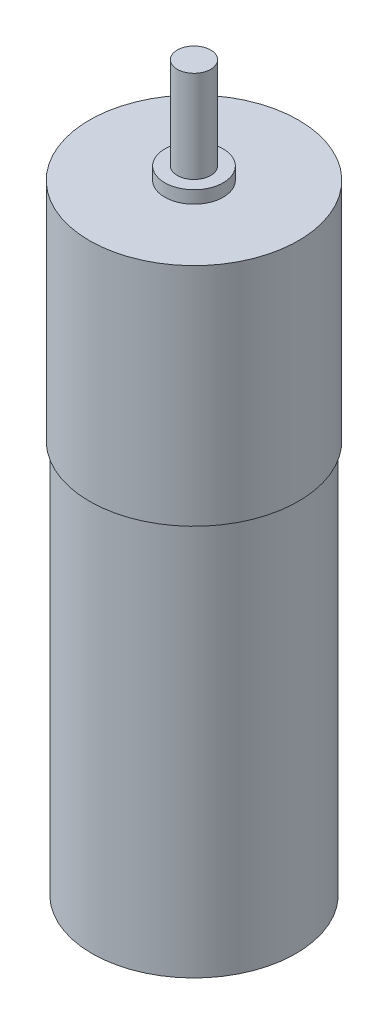
ISO-10303-21;
HEADER;
FILE_DESCRIPTION(('STEP AP214'),'2;1');
FILE_NAME('part.step','',(''),(''),'','','');
FILE_SCHEMA(('AUTOMOTIVE_DESIGN { 1 0 10303 214 1 1 1 1 }'));
ENDSEC;
DATA;
#1=APPLICATION_CONTEXT('core data for automotive mechanical design processes');
#2=APPLICATION_PROTOCOL_DEFINITION('international standard','automotive_design',2000,#1);
#3=PRODUCT_CONTEXT('',#1,'mechanical');
#4=PRODUCT('Part','Part','',(#3));
#5=PRODUCT_RELATED_PRODUCT_CATEGORY('part','',(#4));
#6=PRODUCT_DEFINITION_FORMATION('','',#4);
#7=PRODUCT_DEFINITION_CONTEXT('part definition',#1,'design');
#8=PRODUCT_DEFINITION('design','',#6,#7);
#9=PRODUCT_DEFINITION_SHAPE('','',#8);
#10=(LENGTH_UNIT() NAMED_UNIT(*) SI_UNIT(.MILLI.,.METRE.));
#11=(NAMED_UNIT(*) PLANE_ANGLE_UNIT() SI_UNIT($,.RADIAN.));
#12=(NAMED_UNIT(*) SI_UNIT($,.STERADIAN.) SOLID_ANGLE_UNIT());
#13=UNCERTAINTY_MEASURE_WITH_UNIT(LENGTH_MEASURE(1.E-05),#10,'distance_accuracy_value','');
#14=(GEOMETRIC_REPRESENTATION_CONTEXT(3) GLOBAL_UNCERTAINTY_ASSIGNED_CONTEXT((#13)) GLOBAL_UNIT_ASSIGNED_CONTEXT((#10,
#11,#12)) REPRESENTATION_CONTEXT('',''));
#15=CARTESIAN_POINT('',(0.,0.,0.));
#16=DIRECTION('',(0.,0.,1.));
#17=DIRECTION('',(1.,0.,0.));
#18=AXIS2_PLACEMENT_3D('',#15,#16,#17);
#19=CARTESIAN_POINT('',(0.,23.5,0.));
#20=DIRECTION('',(0.,-1.,0.));
#21=DIRECTION('',(0.,0.,-1.));
#22=AXIS2_PLACEMENT_3D('',#19,#20,#21);
#23=CYLINDRICAL_SURFACE('',#22,12.2);
#24=CARTESIAN_POINT('',(0.,23.5,0.));
#25=DIRECTION('',(0.,1.,0.));
#26=DIRECTION('',(0.,0.,1.));
#27=AXIS2_PLACEMENT_3D('',#24,#25,#26);
#28=CIRCLE('',#27,12.2);
#29=CARTESIAN_POINT('',(0.,23.5,12.2));
#30=VERTEX_POINT('',#29);
#31=EDGE_CURVE('E42',#30,#30,#28,.T.);
#32=ORIENTED_EDGE('',*,*,#31,.F.);
#33=EDGE_LOOP('',(#32));
#34=FACE_BOUND('',#33,.T.);
#35=CARTESIAN_POINT('',(0.,-23.5,0.));
#36=DIRECTION('',(0.,1.,0.));
#37=DIRECTION('',(0.,0.,1.));
#38=AXIS2_PLACEMENT_3D('',#35,#36,#37);
#39=CIRCLE('',#38,12.2);
#40=CARTESIAN_POINT('',(0.,-23.5,12.2));
#41=VERTEX_POINT('',#40);
#42=EDGE_CURVE('E33',#41,#41,#39,.T.);
#43=ORIENTED_EDGE('',*,*,#42,.T.);
#44=EDGE_LOOP('',(#43));
#45=FACE_BOUND('',#44,.T.);
#46=ADVANCED_FACE('F30',(#34,#45),#23,.T.);
#47=CARTESIAN_POINT('',(0.,-23.5,0.));
#48=DIRECTION('',(0.,1.,0.));
#49=DIRECTION('',(0.,0.,1.));
#50=AXIS2_PLACEMENT_3D('',#47,#48,#49);
#51=PLANE('',#50);
#52=ORIENTED_EDGE('',*,*,#42,.F.);
#53=EDGE_LOOP('',(#52));
#54=FACE_BOUND('',#53,.T.);
#55=ADVANCED_FACE('F62',(#54),#51,.F.);
#56=CARTESIAN_POINT('',(0.,50.5,0.));
#57=DIRECTION('',(0.,-1.,0.));
#58=DIRECTION('',(0.,0.,-1.));
#59=AXIS2_PLACEMENT_3D('',#56,#57,#58);
#60=CYLINDRICAL_SURFACE('',#59,12.5);
#61=CARTESIAN_POINT('',(0.,50.5,0.));
#62=DIRECTION('',(0.,1.,0.));
#63=DIRECTION('',(0.,0.,1.));
#64=AXIS2_PLACEMENT_3D('',#61,#62,#63);
#65=CIRCLE('',#64,12.5);
#66=CARTESIAN_POINT('',(0.,50.5,12.5));
#67=VERTEX_POINT('',#66);
#68=EDGE_CURVE('E51',#67,#67,#65,.T.);
#69=ORIENTED_EDGE('',*,*,#68,.F.);
#70=EDGE_LOOP('',(#69));
#71=FACE_BOUND('',#70,.T.);
#72=CARTESIAN_POINT('',(0.,23.5,0.));
#73=DIRECTION('',(0.,1.,0.));
#74=DIRECTION('',(0.,0.,1.));
#75=AXIS2_PLACEMENT_3D('',#72,#73,#74);
#76=CIRCLE('',#75,12.5);
#77=CARTESIAN_POINT('',(0.,23.5,12.5));
#78=VERTEX_POINT('',#77);
#79=EDGE_CURVE('E49',#78,#78,#76,.T.);
#80=ORIENTED_EDGE('',*,*,#79,.T.);
#81=EDGE_LOOP('',(#80));
#82=FACE_BOUND('',#81,.T.);
#83=ADVANCED_FACE('F64',(#71,#82),#60,.T.);
#84=CARTESIAN_POINT('',(0.,50.5,0.));
#85=DIRECTION('',(0.,1.,0.));
#86=DIRECTION('',(0.,0.,1.));
#87=AXIS2_PLACEMENT_3D('',#84,#85,#86);
#88=PLANE('',#87);
#89=CARTESIAN_POINT('',(0.,50.5,0.));
#90=DIRECTION('',(0.,1.,0.));
#91=DIRECTION('',(0.,0.,1.));
#92=AXIS2_PLACEMENT_3D('',#89,#90,#91);
#93=CIRCLE('',#92,3.5);
#94=CARTESIAN_POINT('',(0.,50.5,3.5));
#95=VERTEX_POINT('',#94);
#96=EDGE_CURVE('E37',#95,#95,#93,.T.);
#97=ORIENTED_EDGE('',*,*,#96,.F.);
#98=EDGE_LOOP('',(#97));
#99=FACE_BOUND('',#98,.T.);
#100=ORIENTED_EDGE('',*,*,#68,.T.);
#101=EDGE_LOOP('',(#100));
#102=FACE_BOUND('',#101,.T.);
#103=ADVANCED_FACE('F69',(#99,#102),#88,.T.);
#104=CARTESIAN_POINT('',(0.,23.5,0.));
#105=DIRECTION('',(0.,1.,0.));
#106=DIRECTION('',(0.,0.,1.));
#107=AXIS2_PLACEMENT_3D('',#104,#105,#106);
#108=PLANE('',#107);
#109=ORIENTED_EDGE('',*,*,#31,.T.);
#110=EDGE_LOOP('',(#109));
#111=FACE_BOUND('',#110,.T.);
#112=ORIENTED_EDGE('',*,*,#79,.F.);
#113=EDGE_LOOP('',(#112));
#114=FACE_BOUND('',#113,.T.);
#115=ADVANCED_FACE('F74',(#111,#114),#108,.F.);
#116=CARTESIAN_POINT('',(0.,52.,0.));
#117=DIRECTION('',(0.,-1.,0.));
#118=DIRECTION('',(0.,0.,-1.));
#119=AXIS2_PLACEMENT_3D('',#116,#117,#118);
#120=CYLINDRICAL_SURFACE('',#119,3.5);
#121=CARTESIAN_POINT('',(0.,52.,0.));
#122=DIRECTION('',(0.,1.,0.));
#123=DIRECTION('',(0.,0.,1.));
#124=AXIS2_PLACEMENT_3D('',#121,#122,#123);
#125=CIRCLE('',#124,3.5);
#126=CARTESIAN_POINT('',(0.,52.,3.5));
#127=VERTEX_POINT('',#126);
#128=EDGE_CURVE('E47',#127,#127,#125,.T.);
#129=ORIENTED_EDGE('',*,*,#128,.F.);
#130=EDGE_LOOP('',(#129));
#131=FACE_BOUND('',#130,.T.);
#132=ORIENTED_EDGE('',*,*,#96,.T.);
#133=EDGE_LOOP('',(#132));
#134=FACE_BOUND('',#133,.T.);
#135=ADVANCED_FACE('F77',(#131,#134),#120,.T.);
#136=CARTESIAN_POINT('',(0.,52.,0.));
#137=DIRECTION('',(0.,1.,0.));
#138=DIRECTION('',(0.,0.,1.));
#139=AXIS2_PLACEMENT_3D('',#136,#137,#138);
#140=PLANE('',#139);
#141=CARTESIAN_POINT('',(0.,52.,0.));
#142=DIRECTION('',(0.,1.,0.));
#143=DIRECTION('',(0.,0.,1.));
#144=AXIS2_PLACEMENT_3D('',#141,#142,#143);
#145=CIRCLE('',#144,2.);
#146=CARTESIAN_POINT('',(0.,52.,2.));
#147=VERTEX_POINT('',#146);
#148=EDGE_CURVE('E10',#147,#147,#145,.T.);
#149=ORIENTED_EDGE('',*,*,#148,.F.);
#150=EDGE_LOOP('',(#149));
#151=FACE_BOUND('',#150,.T.);
#152=ORIENTED_EDGE('',*,*,#128,.T.);
#153=EDGE_LOOP('',(#152));
#154=FACE_BOUND('',#153,.T.);
#155=ADVANCED_FACE('F83',(#151,#154),#140,.T.);
#156=CARTESIAN_POINT('',(0.,63.,0.));
#157=DIRECTION('',(0.,-1.,0.));
#158=DIRECTION('',(0.,0.,-1.));
#159=AXIS2_PLACEMENT_3D('',#156,#157,#158);
#160=CYLINDRICAL_SURFACE('',#159,2.);
#161=CARTESIAN_POINT('',(0.,63.,0.));
#162=DIRECTION('',(0.,1.,0.));
#163=DIRECTION('',(0.,0.,1.));
#164=AXIS2_PLACEMENT_3D('',#161,#162,#163);
#165=CIRCLE('',#164,2.);
#166=CARTESIAN_POINT('',(0.,63.,2.));
#167=VERTEX_POINT('',#166);
#168=EDGE_CURVE('E46',#167,#167,#165,.T.);
#169=ORIENTED_EDGE('',*,*,#168,.F.);
#170=EDGE_LOOP('',(#169));
#171=FACE_BOUND('',#170,.T.);
#172=ORIENTED_EDGE('',*,*,#148,.T.);
#173=EDGE_LOOP('',(#172));
#174=FACE_BOUND('',#173,.T.);
#175=ADVANCED_FACE('F87',(#171,#174),#160,.T.);
#176=CARTESIAN_POINT('',(0.,63.,0.));
#177=DIRECTION('',(0.,1.,0.));
#178=DIRECTION('',(0.,0.,1.));
#179=AXIS2_PLACEMENT_3D('',#176,#177,#178);
#180=PLANE('',#179);
#181=ORIENTED_EDGE('',*,*,#168,.T.);
#182=EDGE_LOOP('',(#181));
#183=FACE_BOUND('',#182,.T.);
#184=ADVANCED_FACE('F91',(#183),#180,.T.);
#185=CLOSED_SHELL('',(#46,#55,#83,#103,#115,#135,#155,#175,#184));
#186=MANIFOLD_SOLID_BREP('B2',#185);
#187=ADVANCED_BREP_SHAPE_REPRESENTATION('',(#18,#186),#14);
#188=SHAPE_DEFINITION_REPRESENTATION(#9,#187);
ENDSEC;
END-ISO-10303-21;
